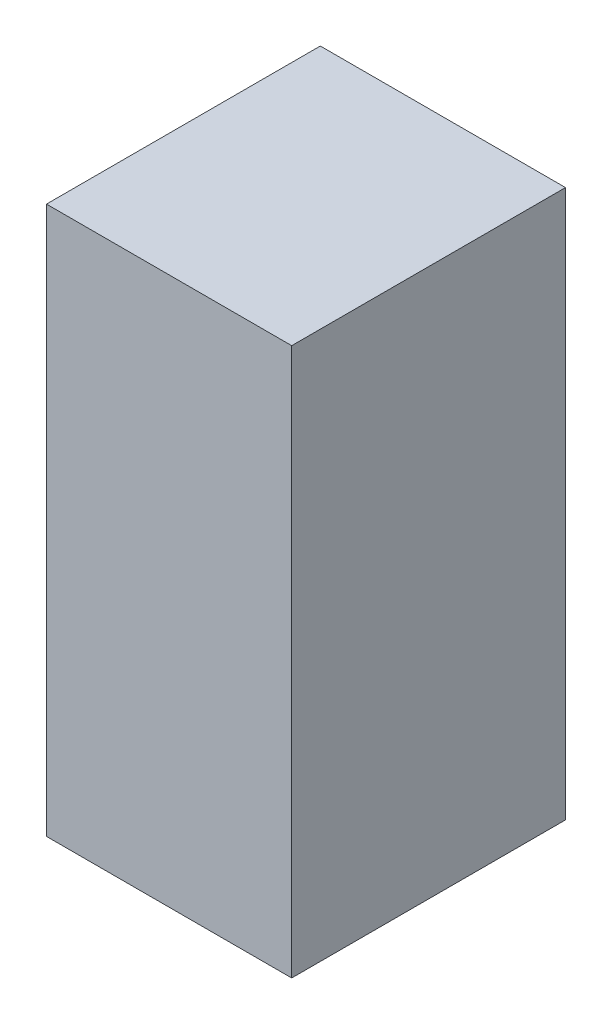
ISO-10303-21;
HEADER;
FILE_DESCRIPTION(('STEP AP214'),'2;1');
FILE_NAME('part.step','',(''),(''),'','','');
FILE_SCHEMA(('AUTOMOTIVE_DESIGN { 1 0 10303 214 1 1 1 1 }'));
ENDSEC;
DATA;
#1=APPLICATION_CONTEXT('core data for automotive mechanical design processes');
#2=APPLICATION_PROTOCOL_DEFINITION('international standard','automotive_design',2000,#1);
#3=PRODUCT_CONTEXT('',#1,'mechanical');
#4=PRODUCT('Part','Part','',(#3));
#5=PRODUCT_RELATED_PRODUCT_CATEGORY('part','',(#4));
#6=PRODUCT_DEFINITION_FORMATION('','',#4);
#7=PRODUCT_DEFINITION_CONTEXT('part definition',#1,'design');
#8=PRODUCT_DEFINITION('design','',#6,#7);
#9=PRODUCT_DEFINITION_SHAPE('','',#8);
#10=(LENGTH_UNIT() NAMED_UNIT(*) SI_UNIT(.MILLI.,.METRE.));
#11=(NAMED_UNIT(*) PLANE_ANGLE_UNIT() SI_UNIT($,.RADIAN.));
#12=(NAMED_UNIT(*) SI_UNIT($,.STERADIAN.) SOLID_ANGLE_UNIT());
#13=UNCERTAINTY_MEASURE_WITH_UNIT(LENGTH_MEASURE(1.E-05),#10,'distance_accuracy_value','');
#14=(GEOMETRIC_REPRESENTATION_CONTEXT(3) GLOBAL_UNCERTAINTY_ASSIGNED_CONTEXT((#13)) GLOBAL_UNIT_ASSIGNED_CONTEXT((#10,
#11,#12)) REPRESENTATION_CONTEXT('',''));
#15=CARTESIAN_POINT('',(0.,0.,0.));
#16=DIRECTION('',(0.,0.,1.));
#17=DIRECTION('',(1.,0.,0.));
#18=AXIS2_PLACEMENT_3D('',#15,#16,#17);
#19=CARTESIAN_POINT('',(-30.0000000000005,134.,67.));
#20=DIRECTION('',(1.,0.,0.));
#21=DIRECTION('',(0.,1.,0.));
#22=AXIS2_PLACEMENT_3D('',#19,#20,#21);
#23=PLANE('',#22);
#24=DIRECTION('',(0.,-1.,0.));
#25=VECTOR('',#24,1.);
#26=CARTESIAN_POINT('',(-30.0000000000005,134.,0.));
#27=LINE('',#26,#25);
#28=CARTESIAN_POINT('',(-30.0000000000005,134.,0.));
#29=VERTEX_POINT('',#28);
#30=CARTESIAN_POINT('',(-30.,0.,0.));
#31=VERTEX_POINT('',#30);
#32=EDGE_CURVE('E94',#29,#31,#27,.T.);
#33=ORIENTED_EDGE('',*,*,#32,.T.);
#34=DIRECTION('',(0.,0.,-1.));
#35=VECTOR('',#34,1.);
#36=CARTESIAN_POINT('',(-30.,0.,67.));
#37=LINE('',#36,#35);
#38=CARTESIAN_POINT('',(-30.,0.,67.));
#39=VERTEX_POINT('',#38);
#40=EDGE_CURVE('E11',#39,#31,#37,.T.);
#41=ORIENTED_EDGE('',*,*,#40,.F.);
#42=DIRECTION('',(0.,-1.,0.));
#43=VECTOR('',#42,1.);
#44=CARTESIAN_POINT('',(-30.0000000000005,134.,67.));
#45=LINE('',#44,#43);
#46=CARTESIAN_POINT('',(-30.0000000000005,134.,67.));
#47=VERTEX_POINT('',#46);
#48=EDGE_CURVE('E82',#47,#39,#45,.T.);
#49=ORIENTED_EDGE('',*,*,#48,.F.);
#50=DIRECTION('',(0.,0.,-1.));
#51=VECTOR('',#50,1.);
#52=CARTESIAN_POINT('',(-30.0000000000005,134.,67.));
#53=LINE('',#52,#51);
#54=EDGE_CURVE('E90',#47,#29,#53,.T.);
#55=ORIENTED_EDGE('',*,*,#54,.T.);
#56=EDGE_LOOP('',(#33,#41,#49,#55));
#57=FACE_BOUND('',#56,.T.);
#58=ADVANCED_FACE('F31',(#57),#23,.F.);
#59=CARTESIAN_POINT('',(-30.,0.,67.));
#60=DIRECTION('',(0.,1.,0.));
#61=DIRECTION('',(0.,0.,1.));
#62=AXIS2_PLACEMENT_3D('',#59,#60,#61);
#63=PLANE('',#62);
#64=DIRECTION('',(1.,0.,0.));
#65=VECTOR('',#64,1.);
#66=CARTESIAN_POINT('',(-30.,0.,0.));
#67=LINE('',#66,#65);
#68=CARTESIAN_POINT('',(30.,0.,0.));
#69=VERTEX_POINT('',#68);
#70=EDGE_CURVE('E86',#31,#69,#67,.T.);
#71=ORIENTED_EDGE('',*,*,#70,.T.);
#72=DIRECTION('',(0.,0.,-1.));
#73=VECTOR('',#72,1.);
#74=CARTESIAN_POINT('',(30.,0.,67.));
#75=LINE('',#74,#73);
#76=CARTESIAN_POINT('',(30.,0.,67.));
#77=VERTEX_POINT('',#76);
#78=EDGE_CURVE('E39',#77,#69,#75,.T.);
#79=ORIENTED_EDGE('',*,*,#78,.F.);
#80=DIRECTION('',(1.,0.,0.));
#81=VECTOR('',#80,1.);
#82=CARTESIAN_POINT('',(-30.,0.,67.));
#83=LINE('',#82,#81);
#84=EDGE_CURVE('E77',#39,#77,#83,.T.);
#85=ORIENTED_EDGE('',*,*,#84,.F.);
#86=ORIENTED_EDGE('',*,*,#40,.T.);
#87=EDGE_LOOP('',(#71,#79,#85,#86));
#88=FACE_BOUND('',#87,.T.);
#89=ADVANCED_FACE('F85',(#88),#63,.F.);
#90=CARTESIAN_POINT('',(30.,134.,67.));
#91=DIRECTION('',(-1.,0.,0.));
#92=DIRECTION('',(0.,0.,1.));
#93=AXIS2_PLACEMENT_3D('',#90,#91,#92);
#94=PLANE('',#93);
#95=DIRECTION('',(0.,1.,0.));
#96=VECTOR('',#95,1.);
#97=CARTESIAN_POINT('',(30.,134.,0.));
#98=LINE('',#97,#96);
#99=CARTESIAN_POINT('',(30.,134.,0.));
#100=VERTEX_POINT('',#99);
#101=EDGE_CURVE('E64',#69,#100,#98,.T.);
#102=ORIENTED_EDGE('',*,*,#101,.T.);
#103=DIRECTION('',(0.,0.,-1.));
#104=VECTOR('',#103,1.);
#105=CARTESIAN_POINT('',(30.,134.,67.));
#106=LINE('',#105,#104);
#107=CARTESIAN_POINT('',(30.,134.,67.));
#108=VERTEX_POINT('',#107);
#109=EDGE_CURVE('E87',#108,#100,#106,.T.);
#110=ORIENTED_EDGE('',*,*,#109,.F.);
#111=DIRECTION('',(0.,1.,0.));
#112=VECTOR('',#111,1.);
#113=CARTESIAN_POINT('',(30.,134.,67.));
#114=LINE('',#113,#112);
#115=EDGE_CURVE('E80',#77,#108,#114,.T.);
#116=ORIENTED_EDGE('',*,*,#115,.F.);
#117=ORIENTED_EDGE('',*,*,#78,.T.);
#118=EDGE_LOOP('',(#102,#110,#116,#117));
#119=FACE_BOUND('',#118,.T.);
#120=ADVANCED_FACE('F88',(#119),#94,.F.);
#121=CARTESIAN_POINT('',(30.,134.,67.));
#122=DIRECTION('',(0.,-1.,0.));
#123=DIRECTION('',(0.,0.,-1.));
#124=AXIS2_PLACEMENT_3D('',#121,#122,#123);
#125=PLANE('',#124);
#126=DIRECTION('',(-1.,0.,0.));
#127=VECTOR('',#126,1.);
#128=CARTESIAN_POINT('',(30.,134.,0.));
#129=LINE('',#128,#127);
#130=EDGE_CURVE('E70',#100,#29,#129,.T.);
#131=ORIENTED_EDGE('',*,*,#130,.T.);
#132=ORIENTED_EDGE('',*,*,#54,.F.);
#133=DIRECTION('',(-1.,0.,0.));
#134=VECTOR('',#133,1.);
#135=CARTESIAN_POINT('',(30.,134.,67.));
#136=LINE('',#135,#134);
#137=EDGE_CURVE('E47',#108,#47,#136,.T.);
#138=ORIENTED_EDGE('',*,*,#137,.F.);
#139=ORIENTED_EDGE('',*,*,#109,.T.);
#140=EDGE_LOOP('',(#131,#132,#138,#139));
#141=FACE_BOUND('',#140,.T.);
#142=ADVANCED_FACE('F101',(#141),#125,.F.);
#143=CARTESIAN_POINT('',(-30.,0.,67.));
#144=DIRECTION('',(0.,0.,1.));
#145=DIRECTION('',(1.,0.,0.));
#146=AXIS2_PLACEMENT_3D('',#143,#144,#145);
#147=PLANE('',#146);
#148=ORIENTED_EDGE('',*,*,#48,.T.);
#149=ORIENTED_EDGE('',*,*,#84,.T.);
#150=ORIENTED_EDGE('',*,*,#115,.T.);
#151=ORIENTED_EDGE('',*,*,#137,.T.);
#152=EDGE_LOOP('',(#148,#149,#150,#151));
#153=FACE_BOUND('',#152,.T.);
#154=ADVANCED_FACE('F78',(#153),#147,.T.);
#155=CARTESIAN_POINT('',(-30.,0.,0.));
#156=DIRECTION('',(0.,0.,1.));
#157=DIRECTION('',(1.,0.,0.));
#158=AXIS2_PLACEMENT_3D('',#155,#156,#157);
#159=PLANE('',#158);
#160=ORIENTED_EDGE('',*,*,#32,.F.);
#161=ORIENTED_EDGE('',*,*,#130,.F.);
#162=ORIENTED_EDGE('',*,*,#101,.F.);
#163=ORIENTED_EDGE('',*,*,#70,.F.);
#164=EDGE_LOOP('',(#160,#161,#162,#163));
#165=FACE_BOUND('',#164,.T.);
#166=ADVANCED_FACE('F104',(#165),#159,.F.);
#167=CLOSED_SHELL('',(#58,#89,#120,#142,#154,#166));
#168=MANIFOLD_SOLID_BREP('B2',#167);
#169=ADVANCED_BREP_SHAPE_REPRESENTATION('',(#18,#168),#14);
#170=SHAPE_DEFINITION_REPRESENTATION(#9,#169);
ENDSEC;
END-ISO-10303-21;
